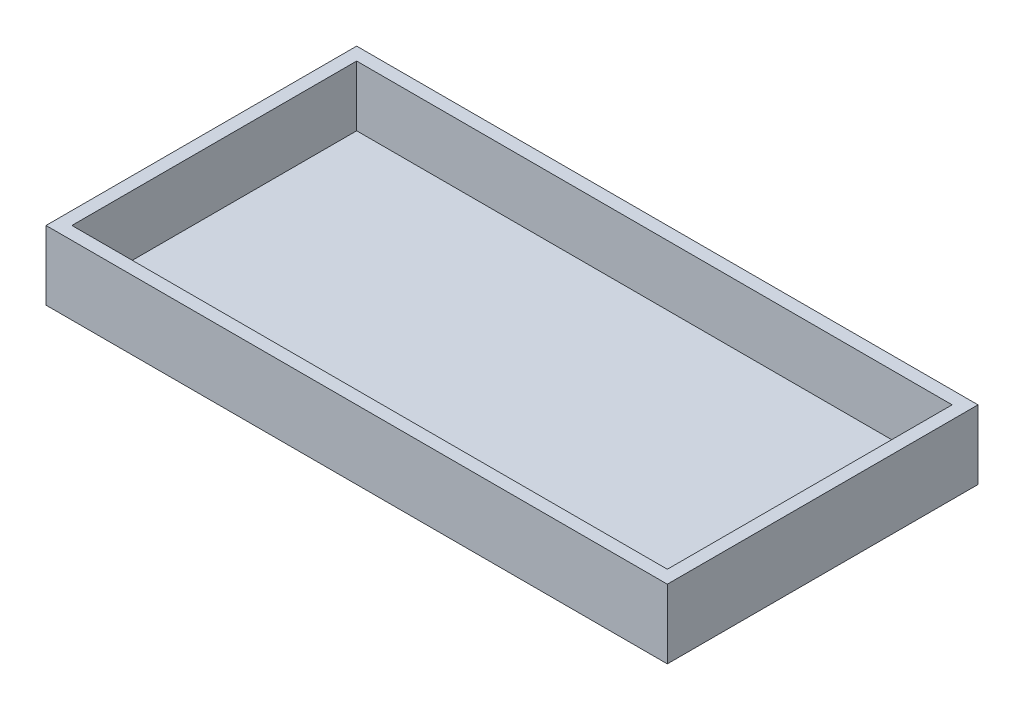
ISO-10303-21;
HEADER;
FILE_DESCRIPTION(('STEP AP214'),'2;1');
FILE_NAME('part.step','',(''),(''),'','','');
FILE_SCHEMA(('AUTOMOTIVE_DESIGN { 1 0 10303 214 1 1 1 1 }'));
ENDSEC;
DATA;
#1=APPLICATION_CONTEXT('core data for automotive mechanical design processes');
#2=APPLICATION_PROTOCOL_DEFINITION('international standard','automotive_design',2000,#1);
#3=PRODUCT_CONTEXT('',#1,'mechanical');
#4=PRODUCT('Part','Part','',(#3));
#5=PRODUCT_RELATED_PRODUCT_CATEGORY('part','',(#4));
#6=PRODUCT_DEFINITION_FORMATION('','',#4);
#7=PRODUCT_DEFINITION_CONTEXT('part definition',#1,'design');
#8=PRODUCT_DEFINITION('design','',#6,#7);
#9=PRODUCT_DEFINITION_SHAPE('','',#8);
#10=(LENGTH_UNIT() NAMED_UNIT(*) SI_UNIT(.MILLI.,.METRE.));
#11=(NAMED_UNIT(*) PLANE_ANGLE_UNIT() SI_UNIT($,.RADIAN.));
#12=(NAMED_UNIT(*) SI_UNIT($,.STERADIAN.) SOLID_ANGLE_UNIT());
#13=UNCERTAINTY_MEASURE_WITH_UNIT(LENGTH_MEASURE(1.E-05),#10,'distance_accuracy_value','');
#14=(GEOMETRIC_REPRESENTATION_CONTEXT(3) GLOBAL_UNCERTAINTY_ASSIGNED_CONTEXT((#13)) GLOBAL_UNIT_ASSIGNED_CONTEXT((#10,
#11,#12)) REPRESENTATION_CONTEXT('',''));
#15=CARTESIAN_POINT('',(0.,0.,0.));
#16=DIRECTION('',(0.,0.,1.));
#17=DIRECTION('',(1.,0.,0.));
#18=AXIS2_PLACEMENT_3D('',#15,#16,#17);
#19=CARTESIAN_POINT('',(0.,-12.7,-457.2));
#20=DIRECTION('',(-1.,0.,0.));
#21=DIRECTION('',(0.,0.,1.));
#22=AXIS2_PLACEMENT_3D('',#19,#20,#21);
#23=PLANE('',#22);
#24=DIRECTION('',(0.,1.,0.));
#25=VECTOR('',#24,1.);
#26=CARTESIAN_POINT('',(0.,-12.7,0.));
#27=LINE('',#26,#25);
#28=CARTESIAN_POINT('',(0.,-12.7,0.));
#29=VERTEX_POINT('',#28);
#30=CARTESIAN_POINT('',(0.,88.9,0.));
#31=VERTEX_POINT('',#30);
#32=EDGE_CURVE('E35',#29,#31,#27,.T.);
#33=ORIENTED_EDGE('',*,*,#32,.T.);
#34=DIRECTION('',(0.,0.,1.));
#35=VECTOR('',#34,1.);
#36=CARTESIAN_POINT('',(0.,88.9,0.));
#37=LINE('',#36,#35);
#38=CARTESIAN_POINT('',(0.,88.9,-457.2));
#39=VERTEX_POINT('',#38);
#40=EDGE_CURVE('E138',#39,#31,#37,.T.);
#41=ORIENTED_EDGE('',*,*,#40,.F.);
#42=DIRECTION('',(0.,1.,0.));
#43=VECTOR('',#42,1.);
#44=CARTESIAN_POINT('',(0.,-12.7,-457.2));
#45=LINE('',#44,#43);
#46=CARTESIAN_POINT('',(0.,-12.7,-457.2));
#47=VERTEX_POINT('',#46);
#48=EDGE_CURVE('E11',#47,#39,#45,.T.);
#49=ORIENTED_EDGE('',*,*,#48,.F.);
#50=DIRECTION('',(0.,0.,1.));
#51=VECTOR('',#50,1.);
#52=CARTESIAN_POINT('',(0.,-12.7,-457.2));
#53=LINE('',#52,#51);
#54=EDGE_CURVE('E144',#47,#29,#53,.T.);
#55=ORIENTED_EDGE('',*,*,#54,.T.);
#56=EDGE_LOOP('',(#33,#41,#49,#55));
#57=FACE_BOUND('',#56,.T.);
#58=ADVANCED_FACE('F32',(#57),#23,.T.);
#59=CARTESIAN_POINT('',(0.,-12.7,-457.2));
#60=DIRECTION('',(0.,0.,-1.));
#61=DIRECTION('',(-1.,0.,0.));
#62=AXIS2_PLACEMENT_3D('',#59,#60,#61);
#63=PLANE('',#62);
#64=ORIENTED_EDGE('',*,*,#48,.T.);
#65=DIRECTION('',(-1.,0.,0.));
#66=VECTOR('',#65,1.);
#67=CARTESIAN_POINT('',(0.,88.9,-457.2));
#68=LINE('',#67,#66);
#69=CARTESIAN_POINT('',(914.4,88.9,-457.2));
#70=VERTEX_POINT('',#69);
#71=EDGE_CURVE('E135',#70,#39,#68,.T.);
#72=ORIENTED_EDGE('',*,*,#71,.F.);
#73=DIRECTION('',(0.,1.,0.));
#74=VECTOR('',#73,1.);
#75=CARTESIAN_POINT('',(914.4,-12.7,-457.2));
#76=LINE('',#75,#74);
#77=CARTESIAN_POINT('',(914.4,-12.7,-457.2));
#78=VERTEX_POINT('',#77);
#79=EDGE_CURVE('E40',#78,#70,#76,.T.);
#80=ORIENTED_EDGE('',*,*,#79,.F.);
#81=DIRECTION('',(-1.,0.,0.));
#82=VECTOR('',#81,1.);
#83=CARTESIAN_POINT('',(0.,-12.7,-457.2));
#84=LINE('',#83,#82);
#85=EDGE_CURVE('E153',#78,#47,#84,.T.);
#86=ORIENTED_EDGE('',*,*,#85,.T.);
#87=EDGE_LOOP('',(#64,#72,#80,#86));
#88=FACE_BOUND('',#87,.T.);
#89=ADVANCED_FACE('F176',(#88),#63,.T.);
#90=CARTESIAN_POINT('',(914.4,-12.7,-457.2));
#91=DIRECTION('',(1.,0.,0.));
#92=DIRECTION('',(0.,0.,-1.));
#93=AXIS2_PLACEMENT_3D('',#90,#91,#92);
#94=PLANE('',#93);
#95=ORIENTED_EDGE('',*,*,#79,.T.);
#96=DIRECTION('',(0.,0.,-1.));
#97=VECTOR('',#96,1.);
#98=CARTESIAN_POINT('',(914.4,88.9,0.));
#99=LINE('',#98,#97);
#100=CARTESIAN_POINT('',(914.4,88.9,0.));
#101=VERTEX_POINT('',#100);
#102=EDGE_CURVE('E111',#101,#70,#99,.T.);
#103=ORIENTED_EDGE('',*,*,#102,.F.);
#104=DIRECTION('',(0.,1.,0.));
#105=VECTOR('',#104,1.);
#106=CARTESIAN_POINT('',(914.4,-12.7,0.));
#107=LINE('',#106,#105);
#108=CARTESIAN_POINT('',(914.4,-12.7,0.));
#109=VERTEX_POINT('',#108);
#110=EDGE_CURVE('E156',#109,#101,#107,.T.);
#111=ORIENTED_EDGE('',*,*,#110,.F.);
#112=DIRECTION('',(0.,0.,-1.));
#113=VECTOR('',#112,1.);
#114=CARTESIAN_POINT('',(914.4,-12.7,-457.2));
#115=LINE('',#114,#113);
#116=EDGE_CURVE('E150',#109,#78,#115,.T.);
#117=ORIENTED_EDGE('',*,*,#116,.T.);
#118=EDGE_LOOP('',(#95,#103,#111,#117));
#119=FACE_BOUND('',#118,.T.);
#120=ADVANCED_FACE('F169',(#119),#94,.T.);
#121=CARTESIAN_POINT('',(0.,-12.7,0.));
#122=DIRECTION('',(0.,0.,1.));
#123=DIRECTION('',(1.,0.,0.));
#124=AXIS2_PLACEMENT_3D('',#121,#122,#123);
#125=PLANE('',#124);
#126=ORIENTED_EDGE('',*,*,#110,.T.);
#127=DIRECTION('',(1.,0.,0.));
#128=VECTOR('',#127,1.);
#129=CARTESIAN_POINT('',(0.,88.9,0.));
#130=LINE('',#129,#128);
#131=EDGE_CURVE('E141',#31,#101,#130,.T.);
#132=ORIENTED_EDGE('',*,*,#131,.F.);
#133=ORIENTED_EDGE('',*,*,#32,.F.);
#134=DIRECTION('',(1.,0.,0.));
#135=VECTOR('',#134,1.);
#136=CARTESIAN_POINT('',(0.,-12.7,0.));
#137=LINE('',#136,#135);
#138=EDGE_CURVE('E147',#29,#109,#137,.T.);
#139=ORIENTED_EDGE('',*,*,#138,.T.);
#140=EDGE_LOOP('',(#126,#132,#133,#139));
#141=FACE_BOUND('',#140,.T.);
#142=ADVANCED_FACE('F166',(#141),#125,.T.);
#143=CARTESIAN_POINT('',(0.,-12.7,0.));
#144=DIRECTION('',(0.,1.,0.));
#145=DIRECTION('',(0.,0.,1.));
#146=AXIS2_PLACEMENT_3D('',#143,#144,#145);
#147=PLANE('',#146);
#148=ORIENTED_EDGE('',*,*,#54,.F.);
#149=ORIENTED_EDGE('',*,*,#85,.F.);
#150=ORIENTED_EDGE('',*,*,#116,.F.);
#151=ORIENTED_EDGE('',*,*,#138,.F.);
#152=EDGE_LOOP('',(#148,#149,#150,#151));
#153=FACE_BOUND('',#152,.T.);
#154=ADVANCED_FACE('F168',(#153),#147,.F.);
#155=CARTESIAN_POINT('',(0.,88.9,0.));
#156=DIRECTION('',(0.,-1.,0.));
#157=DIRECTION('',(0.,0.,-1.));
#158=AXIS2_PLACEMENT_3D('',#155,#156,#157);
#159=PLANE('',#158);
#160=ORIENTED_EDGE('',*,*,#102,.T.);
#161=ORIENTED_EDGE('',*,*,#71,.T.);
#162=ORIENTED_EDGE('',*,*,#40,.T.);
#163=ORIENTED_EDGE('',*,*,#131,.T.);
#164=EDGE_LOOP('',(#160,#161,#162,#163));
#165=FACE_BOUND('',#164,.T.);
#166=DIRECTION('',(0.,0.,1.));
#167=VECTOR('',#166,1.);
#168=CARTESIAN_POINT('',(19.05,88.9,-19.05));
#169=LINE('',#168,#167);
#170=CARTESIAN_POINT('',(19.05,88.9,-438.15));
#171=VERTEX_POINT('',#170);
#172=CARTESIAN_POINT('',(19.05,88.9,-19.05));
#173=VERTEX_POINT('',#172);
#174=EDGE_CURVE('E96',#171,#173,#169,.T.);
#175=ORIENTED_EDGE('',*,*,#174,.F.);
#176=DIRECTION('',(-1.,0.,0.));
#177=VECTOR('',#176,1.);
#178=CARTESIAN_POINT('',(19.05,88.9,-438.15));
#179=LINE('',#178,#177);
#180=CARTESIAN_POINT('',(895.35,88.9,-438.15));
#181=VERTEX_POINT('',#180);
#182=EDGE_CURVE('E119',#181,#171,#179,.T.);
#183=ORIENTED_EDGE('',*,*,#182,.F.);
#184=DIRECTION('',(0.,0.,-1.));
#185=VECTOR('',#184,1.);
#186=CARTESIAN_POINT('',(895.35,88.9,-19.05));
#187=LINE('',#186,#185);
#188=CARTESIAN_POINT('',(895.35,88.9,-19.05));
#189=VERTEX_POINT('',#188);
#190=EDGE_CURVE('E117',#189,#181,#187,.T.);
#191=ORIENTED_EDGE('',*,*,#190,.F.);
#192=DIRECTION('',(1.,0.,0.));
#193=VECTOR('',#192,1.);
#194=CARTESIAN_POINT('',(19.05,88.9,-19.05));
#195=LINE('',#194,#193);
#196=EDGE_CURVE('E105',#173,#189,#195,.T.);
#197=ORIENTED_EDGE('',*,*,#196,.F.);
#198=EDGE_LOOP('',(#175,#183,#191,#197));
#199=FACE_BOUND('',#198,.T.);
#200=ADVANCED_FACE('F115',(#165,#199),#159,.F.);
#201=CARTESIAN_POINT('',(19.05,88.9,-19.05));
#202=DIRECTION('',(1.,0.,0.));
#203=DIRECTION('',(0.,0.,-1.));
#204=AXIS2_PLACEMENT_3D('',#201,#202,#203);
#205=PLANE('',#204);
#206=DIRECTION('',(0.,0.,1.));
#207=VECTOR('',#206,1.);
#208=CARTESIAN_POINT('',(19.05,0.,-19.05));
#209=LINE('',#208,#207);
#210=CARTESIAN_POINT('',(19.05,0.,-438.15));
#211=VERTEX_POINT('',#210);
#212=CARTESIAN_POINT('',(19.05,0.,-19.05));
#213=VERTEX_POINT('',#212);
#214=EDGE_CURVE('E48',#211,#213,#209,.T.);
#215=ORIENTED_EDGE('',*,*,#214,.F.);
#216=DIRECTION('',(0.,-1.,0.));
#217=VECTOR('',#216,1.);
#218=CARTESIAN_POINT('',(19.05,88.9,-438.15));
#219=LINE('',#218,#217);
#220=EDGE_CURVE('E101',#171,#211,#219,.T.);
#221=ORIENTED_EDGE('',*,*,#220,.F.);
#222=ORIENTED_EDGE('',*,*,#174,.T.);
#223=DIRECTION('',(0.,-1.,0.));
#224=VECTOR('',#223,1.);
#225=CARTESIAN_POINT('',(19.05,88.9,-19.05));
#226=LINE('',#225,#224);
#227=EDGE_CURVE('E99',#173,#213,#226,.T.);
#228=ORIENTED_EDGE('',*,*,#227,.T.);
#229=EDGE_LOOP('',(#215,#221,#222,#228));
#230=FACE_BOUND('',#229,.T.);
#231=ADVANCED_FACE('F98',(#230),#205,.T.);
#232=CARTESIAN_POINT('',(19.05,88.9,-19.05));
#233=DIRECTION('',(0.,0.,-1.));
#234=DIRECTION('',(-1.,0.,0.));
#235=AXIS2_PLACEMENT_3D('',#232,#233,#234);
#236=PLANE('',#235);
#237=DIRECTION('',(1.,0.,0.));
#238=VECTOR('',#237,1.);
#239=CARTESIAN_POINT('',(19.05,0.,-19.05));
#240=LINE('',#239,#238);
#241=CARTESIAN_POINT('',(895.35,0.,-19.05));
#242=VERTEX_POINT('',#241);
#243=EDGE_CURVE('E52',#213,#242,#240,.T.);
#244=ORIENTED_EDGE('',*,*,#243,.F.);
#245=ORIENTED_EDGE('',*,*,#227,.F.);
#246=ORIENTED_EDGE('',*,*,#196,.T.);
#247=DIRECTION('',(0.,-1.,0.));
#248=VECTOR('',#247,1.);
#249=CARTESIAN_POINT('',(895.35,88.9,-19.05));
#250=LINE('',#249,#248);
#251=EDGE_CURVE('E112',#189,#242,#250,.T.);
#252=ORIENTED_EDGE('',*,*,#251,.T.);
#253=EDGE_LOOP('',(#244,#245,#246,#252));
#254=FACE_BOUND('',#253,.T.);
#255=ADVANCED_FACE('F109',(#254),#236,.T.);
#256=CARTESIAN_POINT('',(895.35,88.9,-19.05));
#257=DIRECTION('',(-1.,0.,0.));
#258=DIRECTION('',(0.,0.,1.));
#259=AXIS2_PLACEMENT_3D('',#256,#257,#258);
#260=PLANE('',#259);
#261=DIRECTION('',(0.,0.,-1.));
#262=VECTOR('',#261,1.);
#263=CARTESIAN_POINT('',(895.35,0.,-19.05));
#264=LINE('',#263,#262);
#265=CARTESIAN_POINT('',(895.35,0.,-438.15));
#266=VERTEX_POINT('',#265);
#267=EDGE_CURVE('E125',#242,#266,#264,.T.);
#268=ORIENTED_EDGE('',*,*,#267,.F.);
#269=ORIENTED_EDGE('',*,*,#251,.F.);
#270=ORIENTED_EDGE('',*,*,#190,.T.);
#271=DIRECTION('',(0.,-1.,0.));
#272=VECTOR('',#271,1.);
#273=CARTESIAN_POINT('',(895.35,88.9,-438.15));
#274=LINE('',#273,#272);
#275=EDGE_CURVE('E129',#181,#266,#274,.T.);
#276=ORIENTED_EDGE('',*,*,#275,.T.);
#277=EDGE_LOOP('',(#268,#269,#270,#276));
#278=FACE_BOUND('',#277,.T.);
#279=ADVANCED_FACE('F198',(#278),#260,.T.);
#280=CARTESIAN_POINT('',(19.05,88.9,-438.15));
#281=DIRECTION('',(0.,0.,1.));
#282=DIRECTION('',(1.,0.,0.));
#283=AXIS2_PLACEMENT_3D('',#280,#281,#282);
#284=PLANE('',#283);
#285=DIRECTION('',(-1.,0.,0.));
#286=VECTOR('',#285,1.);
#287=CARTESIAN_POINT('',(19.05,0.,-438.15));
#288=LINE('',#287,#286);
#289=EDGE_CURVE('E106',#266,#211,#288,.T.);
#290=ORIENTED_EDGE('',*,*,#289,.F.);
#291=ORIENTED_EDGE('',*,*,#275,.F.);
#292=ORIENTED_EDGE('',*,*,#182,.T.);
#293=ORIENTED_EDGE('',*,*,#220,.T.);
#294=EDGE_LOOP('',(#290,#291,#292,#293));
#295=FACE_BOUND('',#294,.T.);
#296=ADVANCED_FACE('F190',(#295),#284,.T.);
#297=CARTESIAN_POINT('',(0.,0.,0.));
#298=DIRECTION('',(0.,1.,0.));
#299=DIRECTION('',(0.,0.,1.));
#300=AXIS2_PLACEMENT_3D('',#297,#298,#299);
#301=PLANE('',#300);
#302=ORIENTED_EDGE('',*,*,#214,.T.);
#303=ORIENTED_EDGE('',*,*,#243,.T.);
#304=ORIENTED_EDGE('',*,*,#267,.T.);
#305=ORIENTED_EDGE('',*,*,#289,.T.);
#306=EDGE_LOOP('',(#302,#303,#304,#305));
#307=FACE_BOUND('',#306,.T.);
#308=ADVANCED_FACE('F188',(#307),#301,.T.);
#309=CLOSED_SHELL('',(#58,#89,#120,#142,#154,#200,#231,#255,#279,#296,#308));
#310=MANIFOLD_SOLID_BREP('B2',#309);
#311=ADVANCED_BREP_SHAPE_REPRESENTATION('',(#18,#310),#14);
#312=SHAPE_DEFINITION_REPRESENTATION(#9,#311);
ENDSEC;
END-ISO-10303-21;
